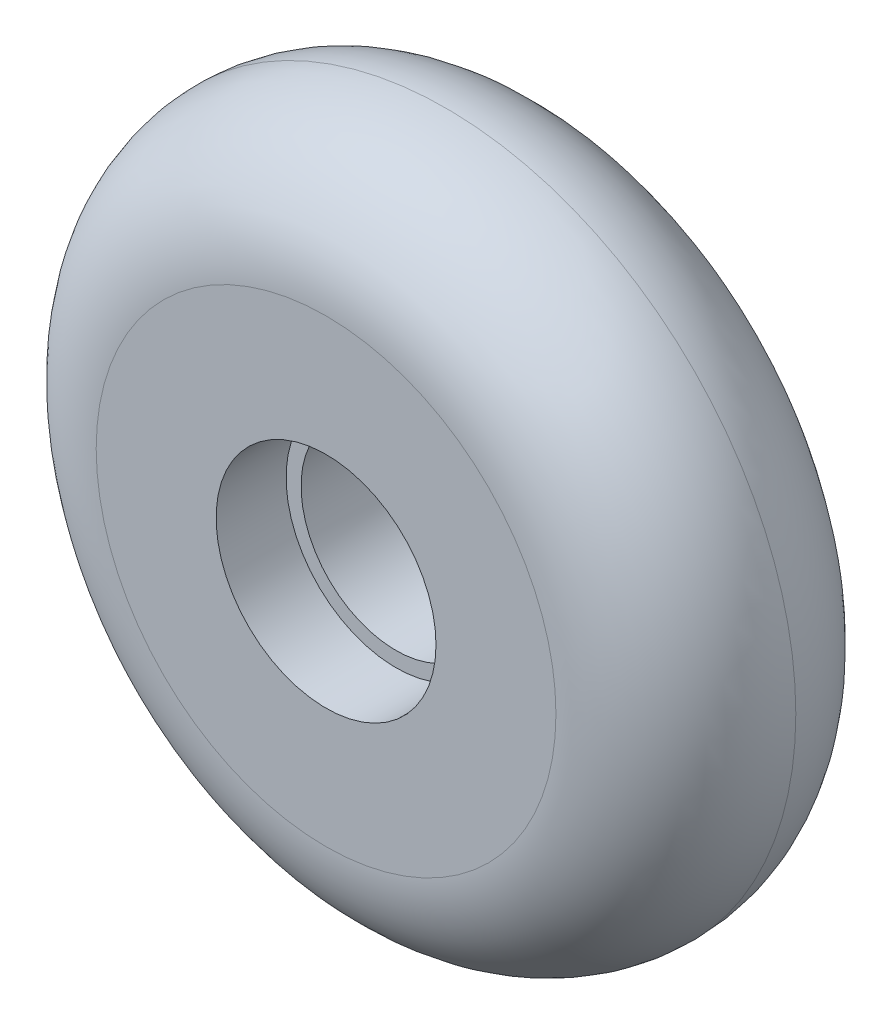
ISO-10303-21;
HEADER;
FILE_DESCRIPTION(('STEP AP214'),'2;1');
FILE_NAME('part.step','',(''),(''),'','','');
FILE_SCHEMA(('AUTOMOTIVE_DESIGN { 1 0 10303 214 1 1 1 1 }'));
ENDSEC;
DATA;
#1=APPLICATION_CONTEXT('core data for automotive mechanical design processes');
#2=APPLICATION_PROTOCOL_DEFINITION('international standard','automotive_design',2000,#1);
#3=PRODUCT_CONTEXT('',#1,'mechanical');
#4=PRODUCT('Part','Part','',(#3));
#5=PRODUCT_RELATED_PRODUCT_CATEGORY('part','',(#4));
#6=PRODUCT_DEFINITION_FORMATION('','',#4);
#7=PRODUCT_DEFINITION_CONTEXT('part definition',#1,'design');
#8=PRODUCT_DEFINITION('design','',#6,#7);
#9=PRODUCT_DEFINITION_SHAPE('','',#8);
#10=(LENGTH_UNIT() NAMED_UNIT(*) SI_UNIT(.MILLI.,.METRE.));
#11=(NAMED_UNIT(*) PLANE_ANGLE_UNIT() SI_UNIT($,.RADIAN.));
#12=(NAMED_UNIT(*) SI_UNIT($,.STERADIAN.) SOLID_ANGLE_UNIT());
#13=UNCERTAINTY_MEASURE_WITH_UNIT(LENGTH_MEASURE(1.E-05),#10,'distance_accuracy_value','');
#14=(GEOMETRIC_REPRESENTATION_CONTEXT(3) GLOBAL_UNCERTAINTY_ASSIGNED_CONTEXT((#13)) GLOBAL_UNIT_ASSIGNED_CONTEXT((#10,
#11,#12)) REPRESENTATION_CONTEXT('',''));
#15=CARTESIAN_POINT('',(0.,0.,0.));
#16=DIRECTION('',(0.,0.,1.));
#17=DIRECTION('',(1.,0.,0.));
#18=AXIS2_PLACEMENT_3D('',#15,#16,#17);
#19=CARTESIAN_POINT('',(0.,0.,24.));
#20=DIRECTION('',(0.,0.,1.));
#21=DIRECTION('',(1.,0.,0.));
#22=AXIS2_PLACEMENT_3D('',#19,#20,#21);
#23=PLANE('',#22);
#24=CARTESIAN_POINT('',(0.,0.,24.));
#25=DIRECTION('',(0.,0.,1.));
#26=DIRECTION('',(1.,0.,0.));
#27=AXIS2_PLACEMENT_3D('',#24,#25,#26);
#28=CIRCLE('',#27,11.);
#29=CARTESIAN_POINT('',(11.,0.,24.));
#30=VERTEX_POINT('',#29);
#31=EDGE_CURVE('E48',#30,#30,#28,.T.);
#32=ORIENTED_EDGE('',*,*,#31,.F.);
#33=EDGE_LOOP('',(#32));
#34=FACE_BOUND('',#33,.T.);
#35=CARTESIAN_POINT('',(0.,0.,24.));
#36=DIRECTION('',(0.,0.,1.));
#37=DIRECTION('',(1.,0.,0.));
#38=AXIS2_PLACEMENT_3D('',#35,#36,#37);
#39=CIRCLE('',#38,23.);
#40=CARTESIAN_POINT('',(23.,0.,24.));
#41=VERTEX_POINT('',#40);
#42=EDGE_CURVE('E40',#41,#41,#39,.T.);
#43=ORIENTED_EDGE('',*,*,#42,.T.);
#44=EDGE_LOOP('',(#43));
#45=FACE_BOUND('',#44,.T.);
#46=ADVANCED_FACE('F29',(#34,#45),#23,.T.);
#47=CARTESIAN_POINT('',(0.,0.,0.));
#48=DIRECTION('',(0.,0.,1.));
#49=DIRECTION('',(1.,0.,0.));
#50=AXIS2_PLACEMENT_3D('',#47,#48,#49);
#51=PLANE('',#50);
#52=CARTESIAN_POINT('',(0.,0.,0.));
#53=DIRECTION('',(0.,0.,-1.));
#54=DIRECTION('',(-1.,0.,0.));
#55=AXIS2_PLACEMENT_3D('',#52,#53,#54);
#56=CIRCLE('',#55,11.);
#57=CARTESIAN_POINT('',(-11.,0.,0.));
#58=VERTEX_POINT('',#57);
#59=EDGE_CURVE('E54',#58,#58,#56,.T.);
#60=ORIENTED_EDGE('',*,*,#59,.F.);
#61=EDGE_LOOP('',(#60));
#62=FACE_BOUND('',#61,.T.);
#63=CARTESIAN_POINT('',(0.,0.,0.));
#64=DIRECTION('',(0.,0.,1.));
#65=DIRECTION('',(1.,0.,0.));
#66=AXIS2_PLACEMENT_3D('',#63,#64,#65);
#67=CIRCLE('',#66,23.);
#68=CARTESIAN_POINT('',(23.,0.,0.));
#69=VERTEX_POINT('',#68);
#70=EDGE_CURVE('E10',#69,#69,#67,.F.);
#71=ORIENTED_EDGE('',*,*,#70,.T.);
#72=EDGE_LOOP('',(#71));
#73=FACE_BOUND('',#72,.T.);
#74=ADVANCED_FACE('F79',(#62,#73),#51,.F.);
#75=CARTESIAN_POINT('',(0.,0.,12.));
#76=DIRECTION('',(0.,0.,1.));
#77=DIRECTION('',(1.,0.,0.));
#78=AXIS2_PLACEMENT_3D('',#75,#76,#77);
#79=TOROIDAL_SURFACE('',#78,23.,12.);
#80=CARTESIAN_POINT('',(0.,0.,12.));
#81=DIRECTION('',(0.,0.,1.));
#82=DIRECTION('',(1.,0.,0.));
#83=AXIS2_PLACEMENT_3D('',#80,#81,#82);
#84=CIRCLE('',#83,35.);
#85=CARTESIAN_POINT('',(35.,0.,12.));
#86=VERTEX_POINT('',#85);
#87=EDGE_CURVE('E36',#86,#86,#84,.F.);
#88=ORIENTED_EDGE('',*,*,#87,.F.);
#89=EDGE_LOOP('',(#88));
#90=FACE_BOUND('',#89,.T.);
#91=ORIENTED_EDGE('',*,*,#42,.F.);
#92=EDGE_LOOP('',(#91));
#93=FACE_BOUND('',#92,.T.);
#94=ADVANCED_FACE('F81',(#90,#93),#79,.T.);
#95=CARTESIAN_POINT('',(0.,0.,12.));
#96=DIRECTION('',(0.,0.,1.));
#97=DIRECTION('',(1.,0.,0.));
#98=AXIS2_PLACEMENT_3D('',#95,#96,#97);
#99=TOROIDAL_SURFACE('',#98,23.,12.);
#100=ORIENTED_EDGE('',*,*,#70,.F.);
#101=EDGE_LOOP('',(#100));
#102=FACE_BOUND('',#101,.T.);
#103=ORIENTED_EDGE('',*,*,#87,.T.);
#104=EDGE_LOOP('',(#103));
#105=FACE_BOUND('',#104,.T.);
#106=ADVANCED_FACE('F86',(#102,#105),#99,.T.);
#107=CARTESIAN_POINT('',(0.,0.,17.));
#108=DIRECTION('',(0.,0.,1.));
#109=DIRECTION('',(1.,0.,0.));
#110=AXIS2_PLACEMENT_3D('',#107,#108,#109);
#111=CYLINDRICAL_SURFACE('',#110,11.);
#112=CARTESIAN_POINT('',(0.,0.,17.));
#113=DIRECTION('',(0.,0.,1.));
#114=DIRECTION('',(1.,0.,0.));
#115=AXIS2_PLACEMENT_3D('',#112,#113,#114);
#116=CIRCLE('',#115,11.);
#117=CARTESIAN_POINT('',(11.,0.,17.));
#118=VERTEX_POINT('',#117);
#119=EDGE_CURVE('E45',#118,#118,#116,.T.);
#120=ORIENTED_EDGE('',*,*,#119,.F.);
#121=EDGE_LOOP('',(#120));
#122=FACE_BOUND('',#121,.T.);
#123=ORIENTED_EDGE('',*,*,#31,.T.);
#124=EDGE_LOOP('',(#123));
#125=FACE_BOUND('',#124,.T.);
#126=ADVANCED_FACE('F93',(#122,#125),#111,.F.);
#127=CARTESIAN_POINT('',(0.,0.,17.));
#128=DIRECTION('',(0.,0.,1.));
#129=DIRECTION('',(1.,0.,0.));
#130=AXIS2_PLACEMENT_3D('',#127,#128,#129);
#131=PLANE('',#130);
#132=CARTESIAN_POINT('',(0.,0.,17.));
#133=DIRECTION('',(0.,0.,1.));
#134=DIRECTION('',(1.,0.,0.));
#135=AXIS2_PLACEMENT_3D('',#132,#133,#134);
#136=CIRCLE('',#135,9.5);
#137=CARTESIAN_POINT('',(9.5,0.,17.));
#138=VERTEX_POINT('',#137);
#139=EDGE_CURVE('E57',#138,#138,#136,.T.);
#140=ORIENTED_EDGE('',*,*,#139,.F.);
#141=EDGE_LOOP('',(#140));
#142=FACE_BOUND('',#141,.T.);
#143=ORIENTED_EDGE('',*,*,#119,.T.);
#144=EDGE_LOOP('',(#143));
#145=FACE_BOUND('',#144,.T.);
#146=ADVANCED_FACE('F75',(#142,#145),#131,.T.);
#147=CARTESIAN_POINT('',(0.,0.,7.));
#148=DIRECTION('',(0.,0.,-1.));
#149=DIRECTION('',(-1.,0.,0.));
#150=AXIS2_PLACEMENT_3D('',#147,#148,#149);
#151=CYLINDRICAL_SURFACE('',#150,11.);
#152=CARTESIAN_POINT('',(0.,0.,7.));
#153=DIRECTION('',(0.,0.,-1.));
#154=DIRECTION('',(-1.,0.,0.));
#155=AXIS2_PLACEMENT_3D('',#152,#153,#154);
#156=CIRCLE('',#155,11.);
#157=CARTESIAN_POINT('',(-11.,0.,7.));
#158=VERTEX_POINT('',#157);
#159=EDGE_CURVE('E51',#158,#158,#156,.T.);
#160=ORIENTED_EDGE('',*,*,#159,.F.);
#161=EDGE_LOOP('',(#160));
#162=FACE_BOUND('',#161,.T.);
#163=ORIENTED_EDGE('',*,*,#59,.T.);
#164=EDGE_LOOP('',(#163));
#165=FACE_BOUND('',#164,.T.);
#166=ADVANCED_FACE('F69',(#162,#165),#151,.F.);
#167=CARTESIAN_POINT('',(0.,0.,7.));
#168=DIRECTION('',(0.,0.,-1.));
#169=DIRECTION('',(-1.,0.,0.));
#170=AXIS2_PLACEMENT_3D('',#167,#168,#169);
#171=PLANE('',#170);
#172=CARTESIAN_POINT('',(0.,0.,7.));
#173=DIRECTION('',(0.,0.,-1.));
#174=DIRECTION('',(-1.,0.,0.));
#175=AXIS2_PLACEMENT_3D('',#172,#173,#174);
#176=CIRCLE('',#175,9.5);
#177=CARTESIAN_POINT('',(-9.5,0.,7.));
#178=VERTEX_POINT('',#177);
#179=EDGE_CURVE('E32',#178,#178,#176,.T.);
#180=ORIENTED_EDGE('',*,*,#179,.F.);
#181=EDGE_LOOP('',(#180));
#182=FACE_BOUND('',#181,.T.);
#183=ORIENTED_EDGE('',*,*,#159,.T.);
#184=EDGE_LOOP('',(#183));
#185=FACE_BOUND('',#184,.T.);
#186=ADVANCED_FACE('F66',(#182,#185),#171,.T.);
#187=CARTESIAN_POINT('',(0.,0.,0.));
#188=DIRECTION('',(0.,0.,1.));
#189=DIRECTION('',(1.,0.,0.));
#190=AXIS2_PLACEMENT_3D('',#187,#188,#189);
#191=CYLINDRICAL_SURFACE('',#190,9.5);
#192=ORIENTED_EDGE('',*,*,#179,.T.);
#193=EDGE_LOOP('',(#192));
#194=FACE_BOUND('',#193,.T.);
#195=ORIENTED_EDGE('',*,*,#139,.T.);
#196=EDGE_LOOP('',(#195));
#197=FACE_BOUND('',#196,.T.);
#198=ADVANCED_FACE('F64',(#194,#197),#191,.F.);
#199=CLOSED_SHELL('',(#46,#74,#94,#106,#126,#146,#166,#186,#198));
#200=MANIFOLD_SOLID_BREP('B2',#199);
#201=ADVANCED_BREP_SHAPE_REPRESENTATION('',(#18,#200),#14);
#202=SHAPE_DEFINITION_REPRESENTATION(#9,#201);
ENDSEC;
END-ISO-10303-21;
